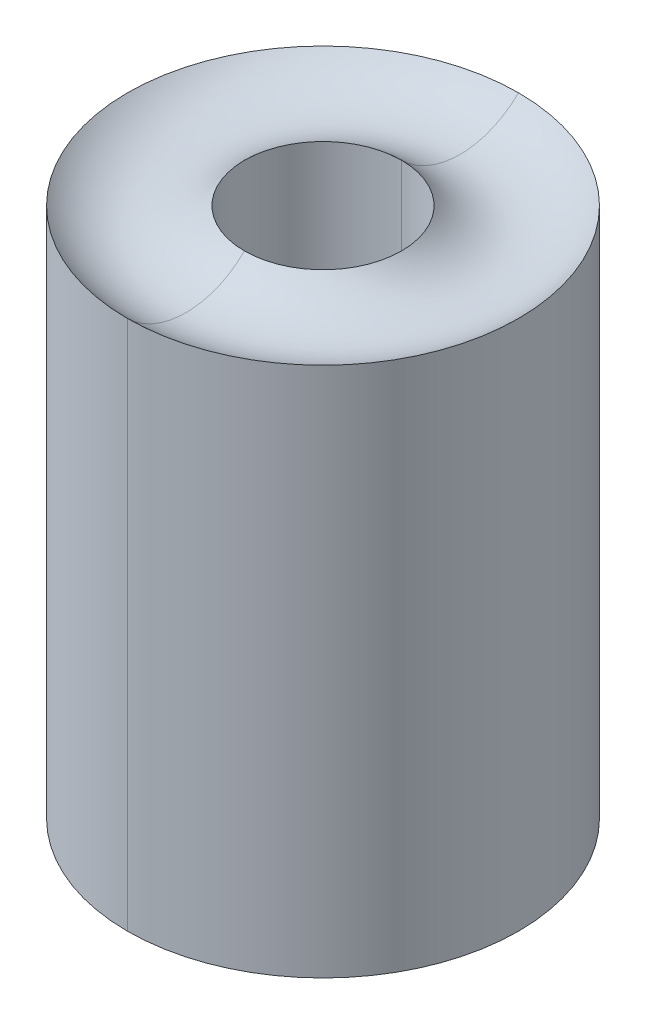
ISO-10303-21;
HEADER;
FILE_DESCRIPTION(('STEP AP214'),'2;1');
FILE_NAME('part.step','',(''),(''),'','','');
FILE_SCHEMA(('AUTOMOTIVE_DESIGN { 1 0 10303 214 1 1 1 1 }'));
ENDSEC;
DATA;
#1=APPLICATION_CONTEXT('core data for automotive mechanical design processes');
#2=APPLICATION_PROTOCOL_DEFINITION('international standard','automotive_design',2000,#1);
#3=PRODUCT_CONTEXT('',#1,'mechanical');
#4=PRODUCT('Part','Part','',(#3));
#5=PRODUCT_RELATED_PRODUCT_CATEGORY('part','',(#4));
#6=PRODUCT_DEFINITION_FORMATION('','',#4);
#7=PRODUCT_DEFINITION_CONTEXT('part definition',#1,'design');
#8=PRODUCT_DEFINITION('design','',#6,#7);
#9=PRODUCT_DEFINITION_SHAPE('','',#8);
#10=(LENGTH_UNIT() NAMED_UNIT(*) SI_UNIT(.MILLI.,.METRE.));
#11=(NAMED_UNIT(*) PLANE_ANGLE_UNIT() SI_UNIT($,.RADIAN.));
#12=(NAMED_UNIT(*) SI_UNIT($,.STERADIAN.) SOLID_ANGLE_UNIT());
#13=UNCERTAINTY_MEASURE_WITH_UNIT(LENGTH_MEASURE(1.E-05),#10,'distance_accuracy_value','');
#14=(GEOMETRIC_REPRESENTATION_CONTEXT(3) GLOBAL_UNCERTAINTY_ASSIGNED_CONTEXT((#13)) GLOBAL_UNIT_ASSIGNED_CONTEXT((#10,
#11,#12)) REPRESENTATION_CONTEXT('',''));
#15=CARTESIAN_POINT('',(0.,0.,0.));
#16=DIRECTION('',(0.,0.,1.));
#17=DIRECTION('',(1.,0.,0.));
#18=AXIS2_PLACEMENT_3D('',#15,#16,#17);
#19=CARTESIAN_POINT('',(0.,27.17046610169,0.));
#20=DIRECTION('',(0.,1.,0.));
#21=DIRECTION('',(0.,0.,1.));
#22=AXIS2_PLACEMENT_3D('',#19,#20,#21);
#23=CYLINDRICAL_SURFACE('',#22,0.225);
#24=CARTESIAN_POINT('',(0.,0.,0.));
#25=DIRECTION('',(0.,1.,0.));
#26=DIRECTION('',(0.,0.,1.));
#27=AXIS2_PLACEMENT_3D('',#24,#25,#26);
#28=CIRCLE('',#27,0.225);
#29=CARTESIAN_POINT('',(0.,0.,0.225));
#30=VERTEX_POINT('',#29);
#31=CARTESIAN_POINT('',(0.,0.,-0.225));
#32=VERTEX_POINT('',#31);
#33=EDGE_CURVE('E11',#30,#32,#28,.T.);
#34=ORIENTED_EDGE('',*,*,#33,.F.);
#35=DIRECTION('',(0.,-1.,0.));
#36=VECTOR('',#35,1.);
#37=CARTESIAN_POINT('',(0.,1.62,0.225));
#38=LINE('',#37,#36);
#39=CARTESIAN_POINT('',(0.,1.62,0.225));
#40=VERTEX_POINT('',#39);
#41=EDGE_CURVE('E105',#40,#30,#38,.T.);
#42=ORIENTED_EDGE('',*,*,#41,.F.);
#43=CARTESIAN_POINT('',(0.,1.62,0.));
#44=DIRECTION('',(0.,-1.,0.));
#45=DIRECTION('',(0.,0.,-1.));
#46=AXIS2_PLACEMENT_3D('',#43,#44,#45);
#47=CIRCLE('',#46,0.225);
#48=CARTESIAN_POINT('',(0.,1.62,-0.225));
#49=VERTEX_POINT('',#48);
#50=EDGE_CURVE('E111',#49,#40,#47,.T.);
#51=ORIENTED_EDGE('',*,*,#50,.F.);
#52=DIRECTION('',(0.,-1.,0.));
#53=VECTOR('',#52,1.);
#54=CARTESIAN_POINT('',(0.,1.62,-0.225));
#55=LINE('',#54,#53);
#56=EDGE_CURVE('E128',#49,#32,#55,.T.);
#57=ORIENTED_EDGE('',*,*,#56,.T.);
#58=EDGE_LOOP('',(#34,#42,#51,#57));
#59=FACE_BOUND('',#58,.T.);
#60=ADVANCED_FACE('F16',(#59),#23,.F.);
#61=CARTESIAN_POINT('',(0.,-0.103125,0.));
#62=DIRECTION('',(0.,1.,0.));
#63=DIRECTION('',(0.,0.,1.));
#64=AXIS2_PLACEMENT_3D('',#61,#62,#63);
#65=TOROIDAL_SURFACE('',#64,0.4,0.203125);
#66=CARTESIAN_POINT('',(0.,0.1,0.));
#67=DIRECTION('',(0.,1.,0.));
#68=DIRECTION('',(0.,0.,1.));
#69=AXIS2_PLACEMENT_3D('',#66,#67,#68);
#70=CIRCLE('',#69,0.4);
#71=CARTESIAN_POINT('',(0.,0.1,0.4));
#72=VERTEX_POINT('',#71);
#73=CARTESIAN_POINT('',(0.,0.1,-0.4));
#74=VERTEX_POINT('',#73);
#75=EDGE_CURVE('E70',#72,#74,#70,.T.);
#76=ORIENTED_EDGE('',*,*,#75,.F.);
#77=CARTESIAN_POINT('',(0.,-0.103125,0.4));
#78=DIRECTION('',(1.,0.,0.));
#79=DIRECTION('',(0.,0.507692307692285,-0.861538461538475));
#80=AXIS2_PLACEMENT_3D('',#77,#78,#79);
#81=CIRCLE('',#80,0.203125);
#82=EDGE_CURVE('E74',#30,#72,#81,.T.);
#83=ORIENTED_EDGE('',*,*,#82,.F.);
#84=ORIENTED_EDGE('',*,*,#33,.T.);
#85=CARTESIAN_POINT('',(0.,-0.103125,-0.4));
#86=DIRECTION('',(-1.,0.,0.));
#87=DIRECTION('',(0.,0.507692307692285,0.861538461538475));
#88=AXIS2_PLACEMENT_3D('',#85,#86,#87);
#89=CIRCLE('',#88,0.203125);
#90=EDGE_CURVE('E77',#32,#74,#89,.T.);
#91=ORIENTED_EDGE('',*,*,#90,.T.);
#92=EDGE_LOOP('',(#76,#83,#84,#91));
#93=FACE_BOUND('',#92,.T.);
#94=ADVANCED_FACE('F72',(#93),#65,.F.);
#95=CARTESIAN_POINT('',(0.,27.17046610169,0.));
#96=DIRECTION('',(0.,1.,0.));
#97=DIRECTION('',(0.,0.,1.));
#98=AXIS2_PLACEMENT_3D('',#95,#96,#97);
#99=CYLINDRICAL_SURFACE('',#98,0.56);
#100=CARTESIAN_POINT('',(0.,0.09999999999999,0.));
#101=DIRECTION('',(0.,-1.,0.));
#102=DIRECTION('',(0.,0.,1.));
#103=AXIS2_PLACEMENT_3D('',#100,#101,#102);
#104=CIRCLE('',#103,0.56);
#105=CARTESIAN_POINT('',(0.,0.09999999999999,0.56));
#106=VERTEX_POINT('',#105);
#107=CARTESIAN_POINT('',(0.,0.09999999999999,-0.56));
#108=VERTEX_POINT('',#107);
#109=EDGE_CURVE('E88',#106,#108,#104,.T.);
#110=ORIENTED_EDGE('',*,*,#109,.F.);
#111=DIRECTION('',(0.,-1.,0.));
#112=VECTOR('',#111,1.);
#113=CARTESIAN_POINT('',(0.,1.62,0.56));
#114=LINE('',#113,#112);
#115=CARTESIAN_POINT('',(0.,1.62,0.56));
#116=VERTEX_POINT('',#115);
#117=EDGE_CURVE('E20',#116,#106,#114,.T.);
#118=ORIENTED_EDGE('',*,*,#117,.F.);
#119=CARTESIAN_POINT('',(0.,1.62,0.));
#120=DIRECTION('',(0.,1.,0.));
#121=DIRECTION('',(0.,0.,-1.));
#122=AXIS2_PLACEMENT_3D('',#119,#120,#121);
#123=CIRCLE('',#122,0.56);
#124=CARTESIAN_POINT('',(0.,1.62,-0.56));
#125=VERTEX_POINT('',#124);
#126=EDGE_CURVE('E142',#125,#116,#123,.T.);
#127=ORIENTED_EDGE('',*,*,#126,.F.);
#128=DIRECTION('',(0.,-1.,0.));
#129=VECTOR('',#128,1.);
#130=CARTESIAN_POINT('',(0.,1.62,-0.56));
#131=LINE('',#130,#129);
#132=EDGE_CURVE('E40',#125,#108,#131,.T.);
#133=ORIENTED_EDGE('',*,*,#132,.T.);
#134=EDGE_LOOP('',(#110,#118,#127,#133));
#135=FACE_BOUND('',#134,.T.);
#136=ADVANCED_FACE('F229',(#135),#99,.T.);
#137=CARTESIAN_POINT('',(0.,27.17046610169,0.));
#138=DIRECTION('',(0.,1.,0.));
#139=DIRECTION('',(0.,0.,1.));
#140=AXIS2_PLACEMENT_3D('',#137,#138,#139);
#141=CYLINDRICAL_SURFACE('',#140,0.56);
#142=ORIENTED_EDGE('',*,*,#132,.F.);
#143=CARTESIAN_POINT('',(0.,1.62,0.));
#144=DIRECTION('',(0.,1.,0.));
#145=DIRECTION('',(0.,0.,1.));
#146=AXIS2_PLACEMENT_3D('',#143,#144,#145);
#147=CIRCLE('',#146,0.56);
#148=EDGE_CURVE('E110',#116,#125,#147,.T.);
#149=ORIENTED_EDGE('',*,*,#148,.F.);
#150=ORIENTED_EDGE('',*,*,#117,.T.);
#151=CARTESIAN_POINT('',(0.,0.09999999999999,0.));
#152=DIRECTION('',(0.,-1.,0.));
#153=DIRECTION('',(0.,0.,-1.));
#154=AXIS2_PLACEMENT_3D('',#151,#152,#153);
#155=CIRCLE('',#154,0.56);
#156=EDGE_CURVE('E81',#108,#106,#155,.T.);
#157=ORIENTED_EDGE('',*,*,#156,.F.);
#158=EDGE_LOOP('',(#142,#149,#150,#157));
#159=FACE_BOUND('',#158,.T.);
#160=ADVANCED_FACE('F194',(#159),#141,.T.);
#161=CARTESIAN_POINT('',(-0.56,0.1,0.));
#162=DIRECTION('',(0.,-1.,0.));
#163=DIRECTION('',(0.,0.,-1.));
#164=AXIS2_PLACEMENT_3D('',#161,#162,#163);
#165=PLANE('',#164);
#166=CARTESIAN_POINT('',(0.,0.1,0.));
#167=DIRECTION('',(0.,1.,0.));
#168=DIRECTION('',(0.,0.,-1.));
#169=AXIS2_PLACEMENT_3D('',#166,#167,#168);
#170=CIRCLE('',#169,0.4);
#171=EDGE_CURVE('E83',#74,#72,#170,.T.);
#172=ORIENTED_EDGE('',*,*,#171,.T.);
#173=ORIENTED_EDGE('',*,*,#75,.T.);
#174=EDGE_LOOP('',(#172,#173));
#175=FACE_BOUND('',#174,.T.);
#176=ORIENTED_EDGE('',*,*,#109,.T.);
#177=ORIENTED_EDGE('',*,*,#156,.T.);
#178=EDGE_LOOP('',(#176,#177));
#179=FACE_BOUND('',#178,.T.);
#180=ADVANCED_FACE('F84',(#175,#179),#165,.T.);
#181=CARTESIAN_POINT('',(0.,-0.103125,0.));
#182=DIRECTION('',(0.,1.,0.));
#183=DIRECTION('',(0.,0.,1.));
#184=AXIS2_PLACEMENT_3D('',#181,#182,#183);
#185=TOROIDAL_SURFACE('',#184,0.4,0.203125);
#186=ORIENTED_EDGE('',*,*,#90,.F.);
#187=CARTESIAN_POINT('',(0.,0.,0.));
#188=DIRECTION('',(0.,1.,0.));
#189=DIRECTION('',(0.,0.,-1.));
#190=AXIS2_PLACEMENT_3D('',#187,#188,#189);
#191=CIRCLE('',#190,0.225);
#192=EDGE_CURVE('E92',#32,#30,#191,.T.);
#193=ORIENTED_EDGE('',*,*,#192,.T.);
#194=ORIENTED_EDGE('',*,*,#82,.T.);
#195=ORIENTED_EDGE('',*,*,#171,.F.);
#196=EDGE_LOOP('',(#186,#193,#194,#195));
#197=FACE_BOUND('',#196,.T.);
#198=ADVANCED_FACE('F90',(#197),#185,.F.);
#199=CARTESIAN_POINT('',(0.,27.17046610169,0.));
#200=DIRECTION('',(0.,1.,0.));
#201=DIRECTION('',(0.,0.,1.));
#202=AXIS2_PLACEMENT_3D('',#199,#200,#201);
#203=CYLINDRICAL_SURFACE('',#202,0.225);
#204=ORIENTED_EDGE('',*,*,#56,.F.);
#205=CARTESIAN_POINT('',(0.,1.62,0.));
#206=DIRECTION('',(0.,-1.,0.));
#207=DIRECTION('',(0.,0.,1.));
#208=AXIS2_PLACEMENT_3D('',#205,#206,#207);
#209=CIRCLE('',#208,0.225);
#210=EDGE_CURVE('E135',#40,#49,#209,.T.);
#211=ORIENTED_EDGE('',*,*,#210,.F.);
#212=ORIENTED_EDGE('',*,*,#41,.T.);
#213=ORIENTED_EDGE('',*,*,#192,.F.);
#214=EDGE_LOOP('',(#204,#211,#212,#213));
#215=FACE_BOUND('',#214,.T.);
#216=ADVANCED_FACE('F18',(#215),#203,.F.);
#217=CARTESIAN_POINT('',(0.,1.7875,0.));
#218=DIRECTION('',(0.,1.,0.));
#219=DIRECTION('',(0.,0.,1.));
#220=AXIS2_PLACEMENT_3D('',#217,#218,#219);
#221=TOROIDAL_SURFACE('',#220,0.3925,0.2368807716975);
#222=CARTESIAN_POINT('',(0.,1.7875,-0.3925));
#223=DIRECTION('',(-1.,0.,0.));
#224=DIRECTION('',(0.,-0.707106781186598,-0.707106781186498));
#225=AXIS2_PLACEMENT_3D('',#222,#223,#224);
#226=CIRCLE('',#225,0.2368807716975);
#227=EDGE_CURVE('E123',#125,#49,#226,.T.);
#228=ORIENTED_EDGE('',*,*,#227,.F.);
#229=ORIENTED_EDGE('',*,*,#126,.T.);
#230=CARTESIAN_POINT('',(0.,1.7875,0.3925));
#231=DIRECTION('',(1.,0.,0.));
#232=DIRECTION('',(0.,-0.707106781186598,0.707106781186498));
#233=AXIS2_PLACEMENT_3D('',#230,#231,#232);
#234=CIRCLE('',#233,0.2368807716975);
#235=EDGE_CURVE('E107',#116,#40,#234,.T.);
#236=ORIENTED_EDGE('',*,*,#235,.T.);
#237=ORIENTED_EDGE('',*,*,#210,.T.);
#238=EDGE_LOOP('',(#228,#229,#236,#237));
#239=FACE_BOUND('',#238,.T.);
#240=ADVANCED_FACE('F139',(#239),#221,.F.);
#241=CARTESIAN_POINT('',(0.,1.7875,0.));
#242=DIRECTION('',(0.,1.,0.));
#243=DIRECTION('',(0.,0.,1.));
#244=AXIS2_PLACEMENT_3D('',#241,#242,#243);
#245=TOROIDAL_SURFACE('',#244,0.3925,0.2368807716975);
#246=ORIENTED_EDGE('',*,*,#50,.T.);
#247=ORIENTED_EDGE('',*,*,#235,.F.);
#248=ORIENTED_EDGE('',*,*,#148,.T.);
#249=ORIENTED_EDGE('',*,*,#227,.T.);
#250=EDGE_LOOP('',(#246,#247,#248,#249));
#251=FACE_BOUND('',#250,.T.);
#252=ADVANCED_FACE('F120',(#251),#245,.F.);
#253=CLOSED_SHELL('',(#60,#94,#136,#160,#180,#198,#216,#240,#252));
#254=MANIFOLD_SOLID_BREP('B1',#253);
#255=ADVANCED_BREP_SHAPE_REPRESENTATION('',(#18,#254),#14);
#256=SHAPE_DEFINITION_REPRESENTATION(#9,#255);
ENDSEC;
END-ISO-10303-21;
